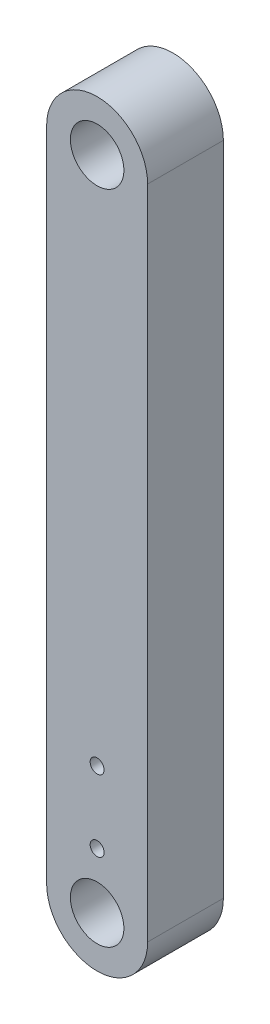
ISO-10303-21;
HEADER;
FILE_DESCRIPTION(('STEP AP214'),'2;1');
FILE_NAME('part.step','',(''),(''),'','','');
FILE_SCHEMA(('AUTOMOTIVE_DESIGN { 1 0 10303 214 1 1 1 1 }'));
ENDSEC;
DATA;
#1=APPLICATION_CONTEXT('core data for automotive mechanical design processes');
#2=APPLICATION_PROTOCOL_DEFINITION('international standard','automotive_design',2000,#1);
#3=PRODUCT_CONTEXT('',#1,'mechanical');
#4=PRODUCT('Part','Part','',(#3));
#5=PRODUCT_RELATED_PRODUCT_CATEGORY('part','',(#4));
#6=PRODUCT_DEFINITION_FORMATION('','',#4);
#7=PRODUCT_DEFINITION_CONTEXT('part definition',#1,'design');
#8=PRODUCT_DEFINITION('design','',#6,#7);
#9=PRODUCT_DEFINITION_SHAPE('','',#8);
#10=(LENGTH_UNIT() NAMED_UNIT(*) SI_UNIT(.MILLI.,.METRE.));
#11=(NAMED_UNIT(*) PLANE_ANGLE_UNIT() SI_UNIT($,.RADIAN.));
#12=(NAMED_UNIT(*) SI_UNIT($,.STERADIAN.) SOLID_ANGLE_UNIT());
#13=UNCERTAINTY_MEASURE_WITH_UNIT(LENGTH_MEASURE(1.E-05),#10,'distance_accuracy_value','');
#14=(GEOMETRIC_REPRESENTATION_CONTEXT(3) GLOBAL_UNCERTAINTY_ASSIGNED_CONTEXT((#13)) GLOBAL_UNIT_ASSIGNED_CONTEXT((#10,
#11,#12)) REPRESENTATION_CONTEXT('',''));
#15=CARTESIAN_POINT('',(0.,0.,0.));
#16=DIRECTION('',(0.,0.,1.));
#17=DIRECTION('',(1.,0.,0.));
#18=AXIS2_PLACEMENT_3D('',#15,#16,#17);
#19=CARTESIAN_POINT('',(0.,0.,9.525));
#20=DIRECTION('',(0.,0.,1.));
#21=DIRECTION('',(1.,0.,0.));
#22=AXIS2_PLACEMENT_3D('',#19,#20,#21);
#23=PLANE('',#22);
#24=CARTESIAN_POINT('',(0.,6.99999997,9.525));
#25=DIRECTION('',(0.,0.,1.));
#26=DIRECTION('',(1.,0.,0.));
#27=AXIS2_PLACEMENT_3D('',#24,#25,#26);
#28=CIRCLE('',#27,0.877000024);
#29=CARTESIAN_POINT('',(0.877000024,6.99999997,9.525));
#30=VERTEX_POINT('',#29);
#31=EDGE_CURVE('E134',#30,#30,#28,.T.);
#32=ORIENTED_EDGE('',*,*,#31,.F.);
#33=EDGE_LOOP('',(#32));
#34=FACE_BOUND('',#33,.T.);
#35=CARTESIAN_POINT('',(0.,16.000000004,9.525));
#36=DIRECTION('',(0.,0.,1.));
#37=DIRECTION('',(1.,0.,0.));
#38=AXIS2_PLACEMENT_3D('',#35,#36,#37);
#39=CIRCLE('',#38,0.877000024);
#40=CARTESIAN_POINT('',(0.877000024,16.000000004,9.525));
#41=VERTEX_POINT('',#40);
#42=EDGE_CURVE('E131',#41,#41,#39,.T.);
#43=ORIENTED_EDGE('',*,*,#42,.F.);
#44=EDGE_LOOP('',(#43));
#45=FACE_BOUND('',#44,.T.);
#46=CARTESIAN_POINT('',(0.,82.55,9.525));
#47=DIRECTION('',(0.,0.,1.));
#48=DIRECTION('',(1.,0.,0.));
#49=AXIS2_PLACEMENT_3D('',#46,#47,#48);
#50=CIRCLE('',#49,3.36549999999999);
#51=CARTESIAN_POINT('',(3.36549999999999,82.55,9.525));
#52=VERTEX_POINT('',#51);
#53=EDGE_CURVE('E104',#52,#52,#50,.T.);
#54=ORIENTED_EDGE('',*,*,#53,.F.);
#55=EDGE_LOOP('',(#54));
#56=FACE_BOUND('',#55,.T.);
#57=CARTESIAN_POINT('',(0.,0.,9.525));
#58=DIRECTION('',(0.,0.,1.));
#59=DIRECTION('',(1.,0.,0.));
#60=AXIS2_PLACEMENT_3D('',#57,#58,#59);
#61=CIRCLE('',#60,6.35);
#62=CARTESIAN_POINT('',(-6.35,0.,9.525));
#63=VERTEX_POINT('',#62);
#64=CARTESIAN_POINT('',(6.35,0.,9.525));
#65=VERTEX_POINT('',#64);
#66=EDGE_CURVE('E89',#63,#65,#61,.T.);
#67=ORIENTED_EDGE('',*,*,#66,.T.);
#68=DIRECTION('',(0.,1.,0.));
#69=VECTOR('',#68,1.);
#70=CARTESIAN_POINT('',(6.35,0.,9.525));
#71=LINE('',#70,#69);
#72=CARTESIAN_POINT('',(6.35,82.55,9.525));
#73=VERTEX_POINT('',#72);
#74=EDGE_CURVE('E84',#65,#73,#71,.T.);
#75=ORIENTED_EDGE('',*,*,#74,.T.);
#76=CARTESIAN_POINT('',(0.,82.55,9.525));
#77=DIRECTION('',(0.,0.,1.));
#78=DIRECTION('',(1.,0.,0.));
#79=AXIS2_PLACEMENT_3D('',#76,#77,#78);
#80=CIRCLE('',#79,6.35);
#81=CARTESIAN_POINT('',(-6.35,82.55,9.525));
#82=VERTEX_POINT('',#81);
#83=EDGE_CURVE('E87',#73,#82,#80,.T.);
#84=ORIENTED_EDGE('',*,*,#83,.T.);
#85=DIRECTION('',(0.,-1.,0.));
#86=VECTOR('',#85,1.);
#87=CARTESIAN_POINT('',(-6.35,0.,9.525));
#88=LINE('',#87,#86);
#89=EDGE_CURVE('E54',#82,#63,#88,.T.);
#90=ORIENTED_EDGE('',*,*,#89,.T.);
#91=EDGE_LOOP('',(#67,#75,#84,#90));
#92=FACE_BOUND('',#91,.T.);
#93=CARTESIAN_POINT('',(0.,0.,9.525));
#94=DIRECTION('',(0.,0.,1.));
#95=DIRECTION('',(1.,0.,0.));
#96=AXIS2_PLACEMENT_3D('',#93,#94,#95);
#97=CIRCLE('',#96,3.3655);
#98=CARTESIAN_POINT('',(3.3655,0.,9.525));
#99=VERTEX_POINT('',#98);
#100=EDGE_CURVE('E119',#99,#99,#97,.T.);
#101=ORIENTED_EDGE('',*,*,#100,.F.);
#102=EDGE_LOOP('',(#101));
#103=FACE_BOUND('',#102,.T.);
#104=ADVANCED_FACE('F37',(#34,#45,#56,#92,#103),#23,.T.);
#105=CARTESIAN_POINT('',(0.,0.,0.));
#106=DIRECTION('',(0.,0.,1.));
#107=DIRECTION('',(1.,0.,0.));
#108=AXIS2_PLACEMENT_3D('',#105,#106,#107);
#109=PLANE('',#108);
#110=CARTESIAN_POINT('',(0.,6.99999997,0.));
#111=DIRECTION('',(0.,0.,1.));
#112=DIRECTION('',(1.,0.,0.));
#113=AXIS2_PLACEMENT_3D('',#110,#111,#112);
#114=CIRCLE('',#113,0.877000024);
#115=CARTESIAN_POINT('',(0.877000024,6.99999997,0.));
#116=VERTEX_POINT('',#115);
#117=EDGE_CURVE('E125',#116,#116,#114,.T.);
#118=ORIENTED_EDGE('',*,*,#117,.T.);
#119=EDGE_LOOP('',(#118));
#120=FACE_BOUND('',#119,.T.);
#121=CARTESIAN_POINT('',(0.,16.000000004,0.));
#122=DIRECTION('',(0.,0.,1.));
#123=DIRECTION('',(1.,0.,0.));
#124=AXIS2_PLACEMENT_3D('',#121,#122,#123);
#125=CIRCLE('',#124,0.877000024);
#126=CARTESIAN_POINT('',(0.877000024,16.000000004,0.));
#127=VERTEX_POINT('',#126);
#128=EDGE_CURVE('E128',#127,#127,#125,.T.);
#129=ORIENTED_EDGE('',*,*,#128,.T.);
#130=EDGE_LOOP('',(#129));
#131=FACE_BOUND('',#130,.T.);
#132=CARTESIAN_POINT('',(0.,0.,0.));
#133=DIRECTION('',(0.,0.,1.));
#134=DIRECTION('',(1.,0.,0.));
#135=AXIS2_PLACEMENT_3D('',#132,#133,#134);
#136=CIRCLE('',#135,6.35);
#137=CARTESIAN_POINT('',(-6.35,0.,0.));
#138=VERTEX_POINT('',#137);
#139=CARTESIAN_POINT('',(6.35,0.,0.));
#140=VERTEX_POINT('',#139);
#141=EDGE_CURVE('E101',#138,#140,#136,.T.);
#142=ORIENTED_EDGE('',*,*,#141,.F.);
#143=DIRECTION('',(0.,-1.,0.));
#144=VECTOR('',#143,1.);
#145=CARTESIAN_POINT('',(-6.35,0.,0.));
#146=LINE('',#145,#144);
#147=CARTESIAN_POINT('',(-6.35,82.55,0.));
#148=VERTEX_POINT('',#147);
#149=EDGE_CURVE('E77',#148,#138,#146,.T.);
#150=ORIENTED_EDGE('',*,*,#149,.F.);
#151=CARTESIAN_POINT('',(0.,82.55,0.));
#152=DIRECTION('',(0.,0.,1.));
#153=DIRECTION('',(1.,0.,0.));
#154=AXIS2_PLACEMENT_3D('',#151,#152,#153);
#155=CIRCLE('',#154,6.35);
#156=CARTESIAN_POINT('',(6.35,82.55,0.));
#157=VERTEX_POINT('',#156);
#158=EDGE_CURVE('E71',#157,#148,#155,.T.);
#159=ORIENTED_EDGE('',*,*,#158,.F.);
#160=DIRECTION('',(0.,1.,0.));
#161=VECTOR('',#160,1.);
#162=CARTESIAN_POINT('',(6.35,0.,0.));
#163=LINE('',#162,#161);
#164=EDGE_CURVE('E93',#140,#157,#163,.T.);
#165=ORIENTED_EDGE('',*,*,#164,.F.);
#166=EDGE_LOOP('',(#142,#150,#159,#165));
#167=FACE_BOUND('',#166,.T.);
#168=CARTESIAN_POINT('',(0.,82.55,0.));
#169=DIRECTION('',(0.,0.,1.));
#170=DIRECTION('',(1.,0.,0.));
#171=AXIS2_PLACEMENT_3D('',#168,#169,#170);
#172=CIRCLE('',#171,3.36549999999999);
#173=CARTESIAN_POINT('',(3.36549999999999,82.55,0.));
#174=VERTEX_POINT('',#173);
#175=EDGE_CURVE('E116',#174,#174,#172,.T.);
#176=ORIENTED_EDGE('',*,*,#175,.T.);
#177=EDGE_LOOP('',(#176));
#178=FACE_BOUND('',#177,.T.);
#179=CARTESIAN_POINT('',(0.,0.,0.));
#180=DIRECTION('',(0.,0.,1.));
#181=DIRECTION('',(1.,0.,0.));
#182=AXIS2_PLACEMENT_3D('',#179,#180,#181);
#183=CIRCLE('',#182,3.3655);
#184=CARTESIAN_POINT('',(3.3655,0.,0.));
#185=VERTEX_POINT('',#184);
#186=EDGE_CURVE('E122',#185,#185,#183,.T.);
#187=ORIENTED_EDGE('',*,*,#186,.T.);
#188=EDGE_LOOP('',(#187));
#189=FACE_BOUND('',#188,.T.);
#190=ADVANCED_FACE('F112',(#120,#131,#167,#178,#189),#109,.F.);
#191=CARTESIAN_POINT('',(0.,0.,9.525));
#192=DIRECTION('',(0.,0.,-1.));
#193=DIRECTION('',(-1.,0.,0.));
#194=AXIS2_PLACEMENT_3D('',#191,#192,#193);
#195=CYLINDRICAL_SURFACE('',#194,6.35);
#196=ORIENTED_EDGE('',*,*,#141,.T.);
#197=DIRECTION('',(0.,0.,-1.));
#198=VECTOR('',#197,1.);
#199=CARTESIAN_POINT('',(6.35,0.,9.525));
#200=LINE('',#199,#198);
#201=EDGE_CURVE('E11',#65,#140,#200,.T.);
#202=ORIENTED_EDGE('',*,*,#201,.F.);
#203=ORIENTED_EDGE('',*,*,#66,.F.);
#204=DIRECTION('',(0.,0.,-1.));
#205=VECTOR('',#204,1.);
#206=CARTESIAN_POINT('',(-6.35,0.,9.525));
#207=LINE('',#206,#205);
#208=EDGE_CURVE('E97',#63,#138,#207,.T.);
#209=ORIENTED_EDGE('',*,*,#208,.T.);
#210=EDGE_LOOP('',(#196,#202,#203,#209));
#211=FACE_BOUND('',#210,.T.);
#212=ADVANCED_FACE('F39',(#211),#195,.T.);
#213=CARTESIAN_POINT('',(6.35,0.,9.525));
#214=DIRECTION('',(-1.,0.,0.));
#215=DIRECTION('',(0.,0.,1.));
#216=AXIS2_PLACEMENT_3D('',#213,#214,#215);
#217=PLANE('',#216);
#218=ORIENTED_EDGE('',*,*,#164,.T.);
#219=DIRECTION('',(0.,0.,-1.));
#220=VECTOR('',#219,1.);
#221=CARTESIAN_POINT('',(6.35,82.55,9.525));
#222=LINE('',#221,#220);
#223=EDGE_CURVE('E46',#73,#157,#222,.T.);
#224=ORIENTED_EDGE('',*,*,#223,.F.);
#225=ORIENTED_EDGE('',*,*,#74,.F.);
#226=ORIENTED_EDGE('',*,*,#201,.T.);
#227=EDGE_LOOP('',(#218,#224,#225,#226));
#228=FACE_BOUND('',#227,.T.);
#229=ADVANCED_FACE('F92',(#228),#217,.F.);
#230=CARTESIAN_POINT('',(0.,82.55,9.525));
#231=DIRECTION('',(0.,0.,-1.));
#232=DIRECTION('',(-1.,0.,0.));
#233=AXIS2_PLACEMENT_3D('',#230,#231,#232);
#234=CYLINDRICAL_SURFACE('',#233,6.35);
#235=ORIENTED_EDGE('',*,*,#158,.T.);
#236=DIRECTION('',(0.,0.,-1.));
#237=VECTOR('',#236,1.);
#238=CARTESIAN_POINT('',(-6.35,82.55,9.525));
#239=LINE('',#238,#237);
#240=EDGE_CURVE('E94',#82,#148,#239,.T.);
#241=ORIENTED_EDGE('',*,*,#240,.F.);
#242=ORIENTED_EDGE('',*,*,#83,.F.);
#243=ORIENTED_EDGE('',*,*,#223,.T.);
#244=EDGE_LOOP('',(#235,#241,#242,#243));
#245=FACE_BOUND('',#244,.T.);
#246=ADVANCED_FACE('F95',(#245),#234,.T.);
#247=CARTESIAN_POINT('',(-6.35,0.,9.525));
#248=DIRECTION('',(1.,0.,0.));
#249=DIRECTION('',(0.,0.,-1.));
#250=AXIS2_PLACEMENT_3D('',#247,#248,#249);
#251=PLANE('',#250);
#252=ORIENTED_EDGE('',*,*,#149,.T.);
#253=ORIENTED_EDGE('',*,*,#208,.F.);
#254=ORIENTED_EDGE('',*,*,#89,.F.);
#255=ORIENTED_EDGE('',*,*,#240,.T.);
#256=EDGE_LOOP('',(#252,#253,#254,#255));
#257=FACE_BOUND('',#256,.T.);
#258=ADVANCED_FACE('F109',(#257),#251,.F.);
#259=CARTESIAN_POINT('',(0.,82.55,9.525));
#260=DIRECTION('',(0.,0.,-1.));
#261=DIRECTION('',(-1.,0.,0.));
#262=AXIS2_PLACEMENT_3D('',#259,#260,#261);
#263=CYLINDRICAL_SURFACE('',#262,3.36549999999999);
#264=ORIENTED_EDGE('',*,*,#53,.T.);
#265=EDGE_LOOP('',(#264));
#266=FACE_BOUND('',#265,.T.);
#267=ORIENTED_EDGE('',*,*,#175,.F.);
#268=EDGE_LOOP('',(#267));
#269=FACE_BOUND('',#268,.T.);
#270=ADVANCED_FACE('F156',(#266,#269),#263,.F.);
#271=CARTESIAN_POINT('',(0.,0.,9.525));
#272=DIRECTION('',(0.,0.,-1.));
#273=DIRECTION('',(-1.,0.,0.));
#274=AXIS2_PLACEMENT_3D('',#271,#272,#273);
#275=CYLINDRICAL_SURFACE('',#274,3.3655);
#276=ORIENTED_EDGE('',*,*,#100,.T.);
#277=EDGE_LOOP('',(#276));
#278=FACE_BOUND('',#277,.T.);
#279=ORIENTED_EDGE('',*,*,#186,.F.);
#280=EDGE_LOOP('',(#279));
#281=FACE_BOUND('',#280,.T.);
#282=ADVANCED_FACE('F159',(#278,#281),#275,.F.);
#283=CARTESIAN_POINT('',(0.,16.000000004,0.));
#284=DIRECTION('',(0.,0.,1.));
#285=DIRECTION('',(1.,0.,0.));
#286=AXIS2_PLACEMENT_3D('',#283,#284,#285);
#287=CYLINDRICAL_SURFACE('',#286,0.877000024);
#288=ORIENTED_EDGE('',*,*,#128,.F.);
#289=EDGE_LOOP('',(#288));
#290=FACE_BOUND('',#289,.T.);
#291=ORIENTED_EDGE('',*,*,#42,.T.);
#292=EDGE_LOOP('',(#291));
#293=FACE_BOUND('',#292,.T.);
#294=ADVANCED_FACE('F145',(#290,#293),#287,.F.);
#295=CARTESIAN_POINT('',(0.,6.99999997,0.));
#296=DIRECTION('',(0.,0.,1.));
#297=DIRECTION('',(1.,0.,0.));
#298=AXIS2_PLACEMENT_3D('',#295,#296,#297);
#299=CYLINDRICAL_SURFACE('',#298,0.877000024);
#300=ORIENTED_EDGE('',*,*,#117,.F.);
#301=EDGE_LOOP('',(#300));
#302=FACE_BOUND('',#301,.T.);
#303=ORIENTED_EDGE('',*,*,#31,.T.);
#304=EDGE_LOOP('',(#303));
#305=FACE_BOUND('',#304,.T.);
#306=ADVANCED_FACE('F142',(#302,#305),#299,.F.);
#307=CLOSED_SHELL('',(#104,#190,#212,#229,#246,#258,#270,#282,#294,#306));
#308=MANIFOLD_SOLID_BREP('B2',#307);
#309=ADVANCED_BREP_SHAPE_REPRESENTATION('',(#18,#308),#14);
#310=SHAPE_DEFINITION_REPRESENTATION(#9,#309);
ENDSEC;
END-ISO-10303-21;
